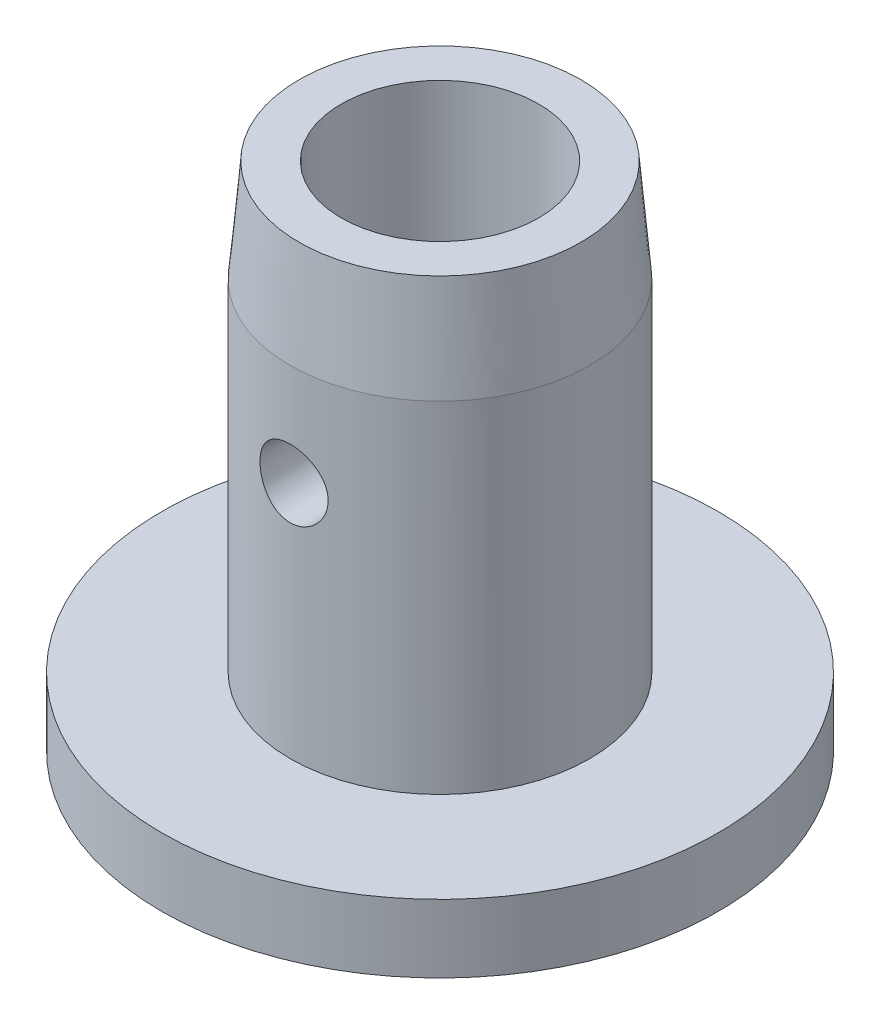
ISO-10303-21;
HEADER;
FILE_DESCRIPTION(('STEP AP214'),'2;1');
FILE_NAME('part.step','',(''),(''),'','','');
FILE_SCHEMA(('AUTOMOTIVE_DESIGN { 1 0 10303 214 1 1 1 1 }'));
ENDSEC;
DATA;
#1=APPLICATION_CONTEXT('core data for automotive mechanical design processes');
#2=APPLICATION_PROTOCOL_DEFINITION('international standard','automotive_design',2000,#1);
#3=PRODUCT_CONTEXT('',#1,'mechanical');
#4=PRODUCT('Part','Part','',(#3));
#5=PRODUCT_RELATED_PRODUCT_CATEGORY('part','',(#4));
#6=PRODUCT_DEFINITION_FORMATION('','',#4);
#7=PRODUCT_DEFINITION_CONTEXT('part definition',#1,'design');
#8=PRODUCT_DEFINITION('design','',#6,#7);
#9=PRODUCT_DEFINITION_SHAPE('','',#8);
#10=(LENGTH_UNIT() NAMED_UNIT(*) SI_UNIT(.MILLI.,.METRE.));
#11=(NAMED_UNIT(*) PLANE_ANGLE_UNIT() SI_UNIT($,.RADIAN.));
#12=(NAMED_UNIT(*) SI_UNIT($,.STERADIAN.) SOLID_ANGLE_UNIT());
#13=UNCERTAINTY_MEASURE_WITH_UNIT(LENGTH_MEASURE(1.E-05),#10,'distance_accuracy_value','');
#14=(GEOMETRIC_REPRESENTATION_CONTEXT(3) GLOBAL_UNCERTAINTY_ASSIGNED_CONTEXT((#13)) GLOBAL_UNIT_ASSIGNED_CONTEXT((#10,
#11,#12)) REPRESENTATION_CONTEXT('',''));
#15=CARTESIAN_POINT('',(0.,0.,0.));
#16=DIRECTION('',(0.,0.,1.));
#17=DIRECTION('',(1.,0.,0.));
#18=AXIS2_PLACEMENT_3D('',#15,#16,#17);
#19=CARTESIAN_POINT('',(0.,2.,0.));
#20=DIRECTION('',(0.,-1.,0.));
#21=DIRECTION('',(0.,0.,-1.));
#22=AXIS2_PLACEMENT_3D('',#19,#20,#21);
#23=CYLINDRICAL_SURFACE('',#22,8.17133289327945);
#24=CARTESIAN_POINT('',(0.,2.,0.));
#25=DIRECTION('',(0.,1.,0.));
#26=DIRECTION('',(0.,0.,1.));
#27=AXIS2_PLACEMENT_3D('',#24,#25,#26);
#28=CIRCLE('',#27,8.17133289327945);
#29=CARTESIAN_POINT('',(0.,2.,8.17133289327945));
#30=VERTEX_POINT('',#29);
#31=EDGE_CURVE('E110',#30,#30,#28,.T.);
#32=ORIENTED_EDGE('',*,*,#31,.F.);
#33=EDGE_LOOP('',(#32));
#34=FACE_BOUND('',#33,.T.);
#35=CARTESIAN_POINT('',(0.,0.,0.));
#36=DIRECTION('',(0.,1.,0.));
#37=DIRECTION('',(0.,0.,1.));
#38=AXIS2_PLACEMENT_3D('',#35,#36,#37);
#39=CIRCLE('',#38,8.17133289327945);
#40=CARTESIAN_POINT('',(0.,0.,8.17133289327945));
#41=VERTEX_POINT('',#40);
#42=EDGE_CURVE('E113',#41,#41,#39,.T.);
#43=ORIENTED_EDGE('',*,*,#42,.T.);
#44=EDGE_LOOP('',(#43));
#45=FACE_BOUND('',#44,.T.);
#46=ADVANCED_FACE('F38',(#34,#45),#23,.T.);
#47=CARTESIAN_POINT('',(0.,2.,0.));
#48=DIRECTION('',(0.,1.,0.));
#49=DIRECTION('',(0.,0.,1.));
#50=AXIS2_PLACEMENT_3D('',#47,#48,#49);
#51=PLANE('',#50);
#52=CARTESIAN_POINT('',(0.,2.,0.));
#53=DIRECTION('',(0.,1.,0.));
#54=DIRECTION('',(0.,0.,1.));
#55=AXIS2_PLACEMENT_3D('',#52,#53,#54);
#56=CIRCLE('',#55,4.4);
#57=CARTESIAN_POINT('',(0.,2.,4.4));
#58=VERTEX_POINT('',#57);
#59=EDGE_CURVE('E114',#58,#58,#56,.F.);
#60=ORIENTED_EDGE('',*,*,#59,.T.);
#61=EDGE_LOOP('',(#60));
#62=FACE_BOUND('',#61,.T.);
#63=ORIENTED_EDGE('',*,*,#31,.T.);
#64=EDGE_LOOP('',(#63));
#65=FACE_BOUND('',#64,.T.);
#66=ADVANCED_FACE('F94',(#62,#65),#51,.T.);
#67=CARTESIAN_POINT('',(0.,0.,0.));
#68=DIRECTION('',(0.,1.,0.));
#69=DIRECTION('',(0.,0.,1.));
#70=AXIS2_PLACEMENT_3D('',#67,#68,#69);
#71=PLANE('',#70);
#72=ORIENTED_EDGE('',*,*,#42,.F.);
#73=EDGE_LOOP('',(#72));
#74=FACE_BOUND('',#73,.T.);
#75=ADVANCED_FACE('F98',(#74),#71,.F.);
#76=CARTESIAN_POINT('',(0.,15.,0.));
#77=DIRECTION('',(0.,1.,0.));
#78=DIRECTION('',(0.,0.,1.));
#79=AXIS2_PLACEMENT_3D('',#76,#77,#78);
#80=PLANE('',#79);
#81=CARTESIAN_POINT('',(0.,15.,0.));
#82=DIRECTION('',(0.,1.,0.));
#83=DIRECTION('',(0.,0.,1.));
#84=AXIS2_PLACEMENT_3D('',#81,#82,#83);
#85=CIRCLE('',#84,4.13753400942223);
#86=CARTESIAN_POINT('',(0.,15.,-4.13753400942223));
#87=VERTEX_POINT('',#86);
#88=EDGE_CURVE('E51',#87,#87,#85,.T.);
#89=ORIENTED_EDGE('',*,*,#88,.T.);
#90=EDGE_LOOP('',(#89));
#91=FACE_BOUND('',#90,.T.);
#92=CARTESIAN_POINT('',(0.,15.,0.));
#93=DIRECTION('',(0.,1.,0.));
#94=DIRECTION('',(1.,0.,0.));
#95=AXIS2_PLACEMENT_3D('',#92,#93,#94);
#96=CIRCLE('',#95,2.9);
#97=CARTESIAN_POINT('',(2.9,15.,0.));
#98=VERTEX_POINT('',#97);
#99=EDGE_CURVE('E117',#98,#98,#96,.T.);
#100=ORIENTED_EDGE('',*,*,#99,.F.);
#101=EDGE_LOOP('',(#100));
#102=FACE_BOUND('',#101,.T.);
#103=ADVANCED_FACE('F92',(#91,#102),#80,.T.);
#104=CARTESIAN_POINT('',(0.,15.,0.));
#105=DIRECTION('',(0.,-1.,0.));
#106=DIRECTION('',(0.,0.,-1.));
#107=AXIS2_PLACEMENT_3D('',#104,#105,#106);
#108=CYLINDRICAL_SURFACE('',#107,4.4);
#109=CARTESIAN_POINT('',(0.,9.99999999999987,-4.4));
#110=CARTESIAN_POINT('',(-0.0554073114387617,9.9999981872693,-4.39999898940741));
#111=CARTESIAN_POINT('',(-0.110836068903203,9.9953795089691,-4.39894283738452));
#112=CARTESIAN_POINT('',(-0.220115437839729,9.97704820957519,-4.3948317281224));
#113=CARTESIAN_POINT('',(-0.273964956888292,9.96332944161776,-4.39177541985059));
#114=CARTESIAN_POINT('',(-0.378491068793966,9.92725278054711,-4.38400381249175));
#115=CARTESIAN_POINT('',(-0.429171037982589,9.90490426880757,-4.37929031542696));
#116=CARTESIAN_POINT('',(-0.526060910330264,9.85223315464752,-4.36871128065081));
#117=CARTESIAN_POINT('',(-0.572270858012729,9.8219106316629,-4.36284575441594));
#118=CARTESIAN_POINT('',(-0.659707041778552,9.7535991821572,-4.35049063267256));
#119=CARTESIAN_POINT('',(-0.700845175568196,9.71549897060986,-4.34399279033303));
#120=CARTESIAN_POINT('',(-0.776205559266441,9.63295241034497,-4.33116260473322));
#121=CARTESIAN_POINT('',(-0.810427152487135,9.58850545972209,-4.32483027723732));
#122=CARTESIAN_POINT('',(-0.871378397607147,9.49386717788639,-4.31296633476884));
#123=CARTESIAN_POINT('',(-0.8980130174263,9.44361320147753,-4.30744526322309));
#124=CARTESIAN_POINT('',(-0.942424278871479,9.33919619976722,-4.29794784590034));
#125=CARTESIAN_POINT('',(-0.960202070870996,9.28503368317522,-4.29397129952671));
#126=CARTESIAN_POINT('',(-0.986101397650873,9.17529632515325,-4.28809737879322));
#127=CARTESIAN_POINT('',(-0.994379570723015,9.11976029475085,-4.2861663189356));
#128=CARTESIAN_POINT('',(-1.00153195380595,9.00805670911462,-4.28450093627071));
#129=CARTESIAN_POINT('',(-1.00040741554621,8.95188923893496,-4.28476632106321));
#130=CARTESIAN_POINT('',(-0.988912067835049,8.84169084666039,-4.28743340143677));
#131=CARTESIAN_POINT('',(-0.978724418397751,8.7876396375219,-4.28979277651903));
#132=CARTESIAN_POINT('',(-0.949682739682008,8.68203420553794,-4.29631494690973));
#133=CARTESIAN_POINT('',(-0.930828189617153,8.63048013294899,-4.30047785058976));
#134=CARTESIAN_POINT('',(-0.884822937610176,8.53082373127565,-4.31017897538147));
#135=CARTESIAN_POINT('',(-0.857602848344031,8.48275459289439,-4.315728623913));
#136=CARTESIAN_POINT('',(-0.795687911681632,8.39179897875544,-4.32757107372966));
#137=CARTESIAN_POINT('',(-0.760991968948537,8.34891326389429,-4.33386398385385));
#138=CARTESIAN_POINT('',(-0.684146072014066,8.26848857527146,-4.34666461149003));
#139=CARTESIAN_POINT('',(-0.64184066697131,8.23109822939332,-4.35317390940599));
#140=CARTESIAN_POINT('',(-0.55148491936389,8.16391764451702,-4.36554010388633));
#141=CARTESIAN_POINT('',(-0.503434456036321,8.13412756532008,-4.37139698673173));
#142=CARTESIAN_POINT('',(-0.402763196719663,8.08295184481126,-4.3818198969855));
#143=CARTESIAN_POINT('',(-0.350131533739264,8.06158689055093,-4.38638273939494));
#144=CARTESIAN_POINT('',(-0.24189804899668,8.02804639765269,-4.39367995826793));
#145=CARTESIAN_POINT('',(-0.186296695865488,8.01586941367099,-4.39641462231136));
#146=CARTESIAN_POINT('',(-0.074975936077093,8.00126950501079,-4.39970600287024));
#147=CARTESIAN_POINT('',(-0.0192844369348151,7.99864372347317,-4.40030800736451));
#148=CARTESIAN_POINT('',(0.0917415546720417,8.00266921594104,-4.39939369020253));
#149=CARTESIAN_POINT('',(0.147076073088344,8.00931980776225,-4.39787752431647));
#150=CARTESIAN_POINT('',(0.255136670887384,8.03154126676203,-4.39292592414966));
#151=CARTESIAN_POINT('',(0.30788601472577,8.04700461857736,-4.389513634822));
#152=CARTESIAN_POINT('',(0.410041572351042,8.0862924109827,-4.38115224529469));
#153=CARTESIAN_POINT('',(0.459447485729155,8.11011760170117,-4.37620300722218));
#154=CARTESIAN_POINT('',(0.554344341024224,8.165867657422,-4.36520573100379));
#155=CARTESIAN_POINT('',(0.599764274090878,8.19791025070913,-4.35914211942128));
#156=CARTESIAN_POINT('',(0.684655094316209,8.26903173137595,-4.34661843825839));
#157=CARTESIAN_POINT('',(0.724125141431879,8.3081116106186,-4.3401583128765));
#158=CARTESIAN_POINT('',(0.796806824872384,8.39313238605323,-4.32741150857947));
#159=CARTESIAN_POINT('',(0.829877466376249,8.43919489671459,-4.32113088477013));
#160=CARTESIAN_POINT('',(0.887815257626211,8.53633855626798,-4.30960093286416));
#161=CARTESIAN_POINT('',(0.912682770004068,8.58741948318372,-4.3043515591837));
#162=CARTESIAN_POINT('',(0.953334388967711,8.69287218782743,-4.29553099482694));
#163=CARTESIAN_POINT('',(0.969170864886819,8.74722292949721,-4.29195015126808));
#164=CARTESIAN_POINT('',(0.991461033361459,8.85790676267952,-4.28685644234325));
#165=CARTESIAN_POINT('',(0.997916365366457,8.91423950605442,-4.28534321564317));
#166=CARTESIAN_POINT('',(1.00118695685666,9.02586344772422,-4.2845801177289));
#167=CARTESIAN_POINT('',(0.998226194004283,9.0811478397333,-4.28527765832708));
#168=CARTESIAN_POINT('',(0.983252461613132,9.19040756407517,-4.28873787387656));
#169=CARTESIAN_POINT('',(0.971239616868036,9.24438291444405,-4.29150052035791));
#170=CARTESIAN_POINT('',(0.938614769442436,9.34929735894638,-4.29875304108193));
#171=CARTESIAN_POINT('',(0.918037830111978,9.40024787645647,-4.30323586674681));
#172=CARTESIAN_POINT('',(0.868898146427518,9.49800588276011,-4.31342588931242));
#173=CARTESIAN_POINT('',(0.840334494924891,9.54481290013007,-4.31913322527863));
#174=CARTESIAN_POINT('',(0.775299987564197,9.63405377106198,-4.33128442905362));
#175=CARTESIAN_POINT('',(0.738670582571336,9.67637028888282,-4.33774162235145));
#176=CARTESIAN_POINT('',(0.65886251572967,9.75432927403265,-4.3505781943722));
#177=CARTESIAN_POINT('',(0.615682334162702,9.78997018838625,-4.35695755466659));
#178=CARTESIAN_POINT('',(0.523256242060226,9.85405522409335,-4.36902773556166));
#179=CARTESIAN_POINT('',(0.473932648750479,9.88238952933312,-4.37470744646846));
#180=CARTESIAN_POINT('',(0.371102387084676,9.93031998826505,-4.38462562205597));
#181=CARTESIAN_POINT('',(0.317599137735078,9.94992319791454,-4.3888652498669));
#182=CARTESIAN_POINT('',(0.220065228615849,9.97649116247032,-4.39470238051135));
#183=CARTESIAN_POINT('',(0.176547244455395,9.98528959507559,-4.39667634233995));
#184=CARTESIAN_POINT('',(0.0886907259723664,9.9970445894316,-4.3993255232295));
#185=CARTESIAN_POINT('',(0.0443522338868403,10.0000014510475,-4.40000080895532));
#186=CARTESIAN_POINT('',(0.,9.99999999999987,-4.4));
#187=B_SPLINE_CURVE_WITH_KNOTS('',3,(#109,#110,#111,#112,#113,#114,#115,#116,#117,#118,#119,
#120,#121,#122,#123,#124,#125,#126,#127,#128,#129,#130,#131,#132,#133,#134,#135,#136,#137,#138,
#139,#140,#141,#142,#143,#144,#145,#146,#147,#148,#149,#150,#151,#152,#153,#154,#155,#156,#157,
#158,#159,#160,#161,#162,#163,#164,#165,#166,#167,#168,#169,#170,#171,#172,#173,#174,#175,#176,
#177,#178,#179,#180,#181,#182,#183,#184,#185,#186),.UNSPECIFIED.,.T.,.F.,(4,2,2,2,2,2,2,2,2,2,2,
2,2,2,2,2,2,2,2,2,2,2,2,2,2,2,2,2,2,2,2,2,2,2,2,2,2,2,4),(0.,0.166059539853326,
0.332231362798772,0.498223047021274,0.664213077722099,0.832769557587234,1.00134203346321,
1.17194145189365,1.34251870615296,1.51024097959232,1.67794092547503,1.84232685669694,
2.00672266701589,2.1725206297554,2.33834290119191,2.50804612721481,2.67775292107945,
2.84787385638659,3.01796802467958,3.18442776766705,3.35087526985451,3.51533430459614,
3.67980809649233,3.84678451731507,4.0137844909027,4.18412528616158,4.35445855023791,
4.52379376763596,4.69309938843759,4.85840817580582,5.02371468423814,5.18835094630459,
5.35300591572721,5.52124410314364,5.68952138008027,5.86019710981387,6.03073465808862,
6.16366819089744,6.29659489965601),.UNSPECIFIED.);
#188=CARTESIAN_POINT('',(0.,9.99999999999987,-4.4));
#189=VERTEX_POINT('',#188);
#190=EDGE_CURVE('E83',#189,#189,#187,.T.);
#191=ORIENTED_EDGE('',*,*,#190,.T.);
#192=EDGE_LOOP('',(#191));
#193=FACE_BOUND('',#192,.T.);
#194=CARTESIAN_POINT('',(1.,8.99999999999986,4.28485705712571));
#195=CARTESIAN_POINT('',(0.999998172956961,8.9446135236298,4.28485817276947));
#196=CARTESIAN_POINT('',(0.995382849343172,8.88920556709911,4.28594265978279));
#197=CARTESIAN_POINT('',(0.977066080954317,8.7799693700087,4.29015466029158));
#198=CARTESIAN_POINT('',(0.963358404266397,8.7261422393923,4.293283575019));
#199=CARTESIAN_POINT('',(0.927314161506233,8.62166357663942,4.30121217836324));
#200=CARTESIAN_POINT('',(0.904987495890804,8.57100847816292,4.30600994937546));
#201=CARTESIAN_POINT('',(0.85236789996246,8.4741606401303,4.31673335036008));
#202=CARTESIAN_POINT('',(0.822075000351155,8.42796788337741,4.32265897598575));
#203=CARTESIAN_POINT('',(0.75379411214335,8.34051380765069,4.33509112165164));
#204=CARTESIAN_POINT('',(0.715688176080844,8.29934568783543,4.34160556858043));
#205=CARTESIAN_POINT('',(0.633117384229795,8.22392699795641,4.3544121154511));
#206=CARTESIAN_POINT('',(0.588652009804052,8.18967699264218,4.36070419720597));
#207=CARTESIAN_POINT('',(0.493996085137725,8.12869478069098,4.37244376401872));
#208=CARTESIAN_POINT('',(0.443746051303528,8.10205271982757,4.37788080393899));
#209=CARTESIAN_POINT('',(0.339337542254579,8.05762663263464,4.38720790566126));
#210=CARTESIAN_POINT('',(0.285179542169808,8.03984153154772,4.39109815514866));
#211=CARTESIAN_POINT('',(0.175462237558956,8.01392876170034,4.39683732833272));
#212=CARTESIAN_POINT('',(0.119941995001517,8.00564320905687,4.39871958722701));
#213=CARTESIAN_POINT('',(0.00826978361641531,7.99847058676739,4.40034637117151));
#214=CARTESIAN_POINT('',(-0.0478821065769237,7.99958235989349,4.40009115943927));
#215=CARTESIAN_POINT('',(-0.158133548364819,8.01105629142925,4.39749706190389));
#216=CARTESIAN_POINT('',(-0.212251852649814,8.02124821120537,4.39519652442152));
#217=CARTESIAN_POINT('',(-0.317989212463346,8.05032123186044,4.38881420037801));
#218=CARTESIAN_POINT('',(-0.369608149136813,8.06920274551721,4.38473232919947));
#219=CARTESIAN_POINT('',(-0.469347777502738,8.11526616394671,4.37518508731984));
#220=CARTESIAN_POINT('',(-0.51743809759723,8.14251156029417,4.36970919059859));
#221=CARTESIAN_POINT('',(-0.608425599826465,8.20448180478223,4.35797268584388));
#222=CARTESIAN_POINT('',(-0.651322020862756,8.23920774703265,4.35171196307727));
#223=CARTESIAN_POINT('',(-0.73171741770942,8.31607656626518,4.33892684265754));
#224=CARTESIAN_POINT('',(-0.769073659913915,8.35836840432002,4.33239968078324));
#225=CARTESIAN_POINT('',(-0.836191680292531,8.44868432629483,4.31994816179905));
#226=CARTESIAN_POINT('',(-0.865953218000971,8.49670859164589,4.31402382377951));
#227=CARTESIAN_POINT('',(-0.917107549511339,8.59736959524376,4.30344067165455));
#228=CARTESIAN_POINT('',(-0.938471463876041,8.65002150156778,4.29878624125749));
#229=CARTESIAN_POINT('',(-0.97200383571757,8.75829942149559,4.29132924906935));
#230=CARTESIAN_POINT('',(-0.984173881419264,8.81392491963799,4.28852636743694));
#231=CARTESIAN_POINT('',(-0.998747680773503,8.92526169906461,4.28515557682541));
#232=CARTESIAN_POINT('',(-1.00136010080838,8.98094425312535,4.28453992406901));
#233=CARTESIAN_POINT('',(-0.997311090863266,9.09194928325798,4.28548419957068));
#234=CARTESIAN_POINT('',(-0.990650353148969,9.1472717858989,4.28704396542803));
#235=CARTESIAN_POINT('',(-0.968425670646868,9.25524731752322,4.29211806935084));
#236=CARTESIAN_POINT('',(-0.952978346986551,9.30792566672219,4.29560678850196));
#237=CARTESIAN_POINT('',(-0.913746038145776,9.40994623697216,4.30412228125607));
#238=CARTESIAN_POINT('',(-0.889960203375691,9.45928811746755,4.30914921157684));
#239=CARTESIAN_POINT('',(-0.834272384379994,9.5541332156156,4.32027846937097));
#240=CARTESIAN_POINT('',(-0.802242843557105,9.59955957561622,4.32639718668424));
#241=CARTESIAN_POINT('',(-0.731142232702455,9.68446932129828,4.33897817783519));
#242=CARTESIAN_POINT('',(-0.69207021495919,9.72395190580734,4.34544049782913));
#243=CARTESIAN_POINT('',(-0.607045959247314,9.7966724392062,4.35813909702996));
#244=CARTESIAN_POINT('',(-0.560970301290904,9.82976756988818,4.36436813813295));
#245=CARTESIAN_POINT('',(-0.463792670514797,9.88774832572189,4.37576120031238));
#246=CARTESIAN_POINT('',(-0.412690941867461,9.91263434942609,4.3809252730885));
#247=CARTESIAN_POINT('',(-0.307242019726363,9.95329616443185,4.38957623439594));
#248=CARTESIAN_POINT('',(-0.252918978508358,9.96913213095943,4.39307417474498));
#249=CARTESIAN_POINT('',(-0.14229451323299,9.99143061894159,4.39804670357271));
#250=CARTESIAN_POINT('',(-0.0859934024474909,9.99789461786559,4.39952161097596));
#251=CARTESIAN_POINT('',(0.0256370570914236,10.0011948464686,4.40027149211534));
#252=CARTESIAN_POINT('',(0.0809599009755024,9.99824363140224,4.3995950355303));
#253=CARTESIAN_POINT('',(0.190299115891744,9.98327562052863,4.3962232064448));
#254=CARTESIAN_POINT('',(0.244315514120923,9.97125901360871,4.39352787600978));
#255=CARTESIAN_POINT('',(0.349328813687535,9.93860654431528,4.38642579305679));
#256=CARTESIAN_POINT('',(0.400336233136022,9.91800302195907,4.3820254662177));
#257=CARTESIAN_POINT('',(0.498197263471666,9.86879230925602,4.37198147671218));
#258=CARTESIAN_POINT('',(0.545050436696177,9.84018427692565,4.36633768326047));
#259=CARTESIAN_POINT('',(0.634302521137273,9.77509521414182,4.3542774053487));
#260=CARTESIAN_POINT('',(0.676591592587167,9.73846603423756,4.34784755156389));
#261=CARTESIAN_POINT('',(0.754495319914402,9.65867041188418,4.33500855980384));
#262=CARTESIAN_POINT('',(0.790108346416117,9.61550237817868,4.32859942726003));
#263=CARTESIAN_POINT('',(0.854156028821747,9.52309120246178,4.3164219710509));
#264=CARTESIAN_POINT('',(0.88247751886789,9.47376811481237,4.31066444700259));
#265=CARTESIAN_POINT('',(0.930384150346576,9.37094045945109,4.3005800960967));
#266=CARTESIAN_POINT('',(0.949976421612277,9.31743934639512,4.29625210238051));
#267=CARTESIAN_POINT('',(0.976519641845292,9.21993281701977,4.2902853761763));
#268=CARTESIAN_POINT('',(0.985307313189316,9.17644153097361,4.28826372072279));
#269=CARTESIAN_POINT('',(0.997048057349155,9.08863805127284,4.28554915257795));
#270=CARTESIAN_POINT('',(1.00000146218609,9.0443259044773,4.28485616427384));
#271=CARTESIAN_POINT('',(1.,8.99999999999986,4.28485705712571));
#272=B_SPLINE_CURVE_WITH_KNOTS('',3,(#194,#195,#196,#197,#198,#199,#200,#201,#202,#203,#204,
#205,#206,#207,#208,#209,#210,#211,#212,#213,#214,#215,#216,#217,#218,#219,#220,#221,#222,#223,
#224,#225,#226,#227,#228,#229,#230,#231,#232,#233,#234,#235,#236,#237,#238,#239,#240,#241,#242,
#243,#244,#245,#246,#247,#248,#249,#250,#251,#252,#253,#254,#255,#256,#257,#258,#259,#260,#261,
#262,#263,#264,#265,#266,#267,#268,#269,#270,#271),.UNSPECIFIED.,.T.,.F.,(4,2,2,2,2,2,2,2,2,2,2,
2,2,2,2,2,2,2,2,2,2,2,2,2,2,2,2,2,2,2,2,2,2,2,2,2,2,2,4),(0.,0.165996897304268,
0.332107686866146,0.498028233398954,0.663948140488661,0.832586549056412,1.00123871860007,
1.17181335496867,1.34236728772629,1.51004351270337,1.67769908959608,1.84227602663752,
2.00686078230906,2.17272718731547,2.33861786854887,2.50823146034773,2.67785042183393,
2.84804770384368,3.01821557784071,3.18464532088969,3.35106264018548,3.51532104907985,
3.67959619871091,3.84658448380192,4.0135952574345,4.1839917038932,4.35437987637933,
4.52362152049452,4.69283648114635,4.85825855136596,5.02367717493189,5.18847835000317,
5.35329686680728,5.52146406492036,5.68967225314152,5.86035204221535,6.03089216709,
6.16374736685087,6.29659500576361),.UNSPECIFIED.);
#273=CARTESIAN_POINT('',(1.,8.99999999999986,4.28485705712571));
#274=VERTEX_POINT('',#273);
#275=EDGE_CURVE('E77',#274,#274,#272,.T.);
#276=ORIENTED_EDGE('',*,*,#275,.T.);
#277=EDGE_LOOP('',(#276));
#278=FACE_BOUND('',#277,.T.);
#279=CARTESIAN_POINT('',(0.,11.9999999999999,0.));
#280=DIRECTION('',(0.,1.,0.));
#281=DIRECTION('',(0.,0.,1.));
#282=AXIS2_PLACEMENT_3D('',#279,#280,#281);
#283=CIRCLE('',#282,4.4);
#284=CARTESIAN_POINT('',(0.,11.9999999999999,-4.4));
#285=VERTEX_POINT('',#284);
#286=EDGE_CURVE('E11',#285,#285,#283,.F.);
#287=ORIENTED_EDGE('',*,*,#286,.T.);
#288=EDGE_LOOP('',(#287));
#289=FACE_BOUND('',#288,.T.);
#290=ORIENTED_EDGE('',*,*,#59,.F.);
#291=EDGE_LOOP('',(#290));
#292=FACE_BOUND('',#291,.T.);
#293=ADVANCED_FACE('F88',(#193,#278,#289,#292),#108,.T.);
#294=CARTESIAN_POINT('',(0.,15.,0.));
#295=DIRECTION('',(0.,-1.,0.));
#296=DIRECTION('',(0.,0.,-1.));
#297=AXIS2_PLACEMENT_3D('',#294,#295,#296);
#298=CYLINDRICAL_SURFACE('',#297,2.9);
#299=CARTESIAN_POINT('',(0.,9.99999999999987,-2.9));
#300=CARTESIAN_POINT('',(-0.0544552131136731,10.0000006506837,-2.90000044596642));
#301=CARTESIAN_POINT('',(-0.108905818143274,9.99553760558662,-2.89845224840839));
#302=CARTESIAN_POINT('',(-0.216196775235785,9.9778625828751,-2.89242923061449));
#303=CARTESIAN_POINT('',(-0.269037070312184,9.964650296013,-2.88795430693165));
#304=CARTESIAN_POINT('',(-0.371545174459086,9.92998803148389,-2.87656253190446));
#305=CARTESIAN_POINT('',(-0.421218333321002,9.90855239870091,-2.8696499345483));
#306=CARTESIAN_POINT('',(-0.516263627133062,9.85811892742604,-2.85408377479631));
#307=CARTESIAN_POINT('',(-0.561634820702117,9.82911943895072,-2.84542983263685));
#308=CARTESIAN_POINT('',(-0.64845582065183,9.76326361656829,-2.82693147875981));
#309=CARTESIAN_POINT('',(-0.689725893574247,9.72617879916895,-2.8170571236675));
#310=CARTESIAN_POINT('',(-0.765600385970797,9.64569051696745,-2.79739079412223));
#311=CARTESIAN_POINT('',(-0.800203196229213,9.60228553115176,-2.78759884010168));
#312=CARTESIAN_POINT('',(-0.86281727541276,9.50873463339349,-2.76887163076295));
#313=CARTESIAN_POINT('',(-0.890589582412287,9.45842083096769,-2.75997257294439));
#314=CARTESIAN_POINT('',(-0.937200454960444,9.35348038290123,-2.74449684570883));
#315=CARTESIAN_POINT('',(-0.956041966482225,9.29885516639866,-2.73791941064857));
#316=CARTESIAN_POINT('',(-0.983572670144409,9.18889409302674,-2.7281482054121));
#317=CARTESIAN_POINT('',(-0.992600441334165,9.13365330625254,-2.72484197013287));
#318=CARTESIAN_POINT('',(-1.00130604229978,9.02234969381725,-2.72165570572462));
#319=CARTESIAN_POINT('',(-1.00098700566359,8.96628714995655,-2.72177452831886));
#320=CARTESIAN_POINT('',(-0.991269850118853,8.85787207614402,-2.72532681352706));
#321=CARTESIAN_POINT('',(-0.982320585940334,8.80547299799653,-2.72859640013378));
#322=CARTESIAN_POINT('',(-0.956331839402051,8.70297153823126,-2.73781254728096));
#323=CARTESIAN_POINT('',(-0.939291324321129,8.65286945068363,-2.74375944953372));
#324=CARTESIAN_POINT('',(-0.897322903330796,8.55539258607528,-2.75777199360075));
#325=CARTESIAN_POINT('',(-0.872266490935071,8.50807825649422,-2.76587176369009));
#326=CARTESIAN_POINT('',(-0.815066789795993,8.41818695276921,-2.783263880601));
#327=CARTESIAN_POINT('',(-0.782921341272507,8.37561142833372,-2.79255659050807));
#328=CARTESIAN_POINT('',(-0.710327432141071,8.29389358509846,-2.81192482917279));
#329=CARTESIAN_POINT('',(-0.66951422536393,8.25507806552534,-2.82201502155233));
#330=CARTESIAN_POINT('',(-0.581835205740511,8.18475380208939,-2.84138718920041));
#331=CARTESIAN_POINT('',(-0.534968728887011,8.15324586088543,-2.85066907561537));
#332=CARTESIAN_POINT('',(-0.435783492056977,8.09814312054725,-2.86751598276309));
#333=CARTESIAN_POINT('',(-0.383409250154941,8.07464147960904,-2.87506048104625));
#334=CARTESIAN_POINT('',(-0.2751274425281,8.03688574415438,-2.88743285339349));
#335=CARTESIAN_POINT('',(-0.21922120271381,8.02262820177992,-2.89226174023537));
#336=CARTESIAN_POINT('',(-0.108224709923492,8.00435732086242,-2.89848829144024));
#337=CARTESIAN_POINT('',(-0.0532152680158842,7.9999028170644,-2.90003360783231));
#338=CARTESIAN_POINT('',(0.056779550915997,8.00010035885299,-2.89996529704204));
#339=CARTESIAN_POINT('',(0.111764930499342,8.00475074403706,-2.89835224583175));
#340=CARTESIAN_POINT('',(0.218347956211726,8.0226802857086,-2.89224600856489));
#341=CARTESIAN_POINT('',(0.269997763336055,8.03568385256146,-2.88784486957406));
#342=CARTESIAN_POINT('',(0.370357971541551,8.06960125249792,-2.87669713597174));
#343=CARTESIAN_POINT('',(0.41906799267972,8.090516105522,-2.86995023894901));
#344=CARTESIAN_POINT('',(0.513648423190477,8.14029137179801,-2.85456212899072));
#345=CARTESIAN_POINT('',(0.559405187888158,8.16935288865492,-2.84587427954393));
#346=CARTESIAN_POINT('',(0.645533254519413,8.2343628787571,-2.82758351550565));
#347=CARTESIAN_POINT('',(0.685902804987562,8.27031358257312,-2.81798030504744));
#348=CARTESIAN_POINT('',(0.762163237880085,8.35015331993382,-2.79834486508445));
#349=CARTESIAN_POINT('',(0.797739503725268,8.39434408738377,-2.78831456408555));
#350=CARTESIAN_POINT('',(0.861016541925032,8.48828024570908,-2.76943033661311));
#351=CARTESIAN_POINT('',(0.888717109397741,8.53802578104172,-2.76057644074627));
#352=CARTESIAN_POINT('',(0.935361434808084,8.64176847153171,-2.74512401059867));
#353=CARTESIAN_POINT('',(0.954311078797978,8.69576274020966,-2.73852396111492));
#354=CARTESIAN_POINT('',(0.982752974203085,8.80645933943221,-2.72844803900345));
#355=CARTESIAN_POINT('',(0.992249888363337,8.86316032035836,-2.72497062615665));
#356=CARTESIAN_POINT('',(1.00113784748312,8.97431251376181,-2.72171694741471));
#357=CARTESIAN_POINT('',(1.00105477688971,9.02871647449048,-2.72174808083967));
#358=CARTESIAN_POINT('',(0.992093555043035,9.13669128524179,-2.72502708681539));
#359=CARTESIAN_POINT('',(0.983216000098469,9.19026219149942,-2.72827474127043));
#360=CARTESIAN_POINT('',(0.957300754008808,9.29388244154613,-2.73747268908473));
#361=CARTESIAN_POINT('',(0.940444949368938,9.34398306532212,-2.74336259585187));
#362=CARTESIAN_POINT('',(0.899202062594745,9.44068174980649,-2.75715545901479));
#363=CARTESIAN_POINT('',(0.874813238279691,9.4872789971771,-2.76505888100725));
#364=CARTESIAN_POINT('',(0.817886181877109,9.5779789519226,-2.78244237950148));
#365=CARTESIAN_POINT('',(0.785024027508346,9.62186755615343,-2.79197835282225));
#366=CARTESIAN_POINT('',(0.712618196014424,9.7036767739812,-2.81133029201349));
#367=CARTESIAN_POINT('',(0.673072567850672,9.74159563863147,-2.82114633894552));
#368=CARTESIAN_POINT('',(0.586391890905794,9.81203064553149,-2.84045700643123));
#369=CARTESIAN_POINT('',(0.539004418543626,9.8442460125274,-2.84991987810608));
#370=CARTESIAN_POINT('',(0.439168450163447,9.90022463483973,-2.86700043276144));
#371=CARTESIAN_POINT('',(0.386720826784196,9.92398934419783,-2.87461843310318));
#372=CARTESIAN_POINT('',(0.279395305096888,9.96182370897986,-2.8870038017781));
#373=CARTESIAN_POINT('',(0.224594079770421,9.9760911524302,-2.89182903316074));
#374=CARTESIAN_POINT('',(0.113193181266236,9.99517741573334,-2.89832638525487));
#375=CARTESIAN_POINT('',(0.056594102040427,9.99999932375852,-2.89999953651693));
#376=CARTESIAN_POINT('',(0.,9.99999999999987,-2.9));
#377=B_SPLINE_CURVE_WITH_KNOTS('',3,(#299,#300,#301,#302,#303,#304,#305,#306,#307,#308,#309,
#310,#311,#312,#313,#314,#315,#316,#317,#318,#319,#320,#321,#322,#323,#324,#325,#326,#327,#328,
#329,#330,#331,#332,#333,#334,#335,#336,#337,#338,#339,#340,#341,#342,#343,#344,#345,#346,#347,
#348,#349,#350,#351,#352,#353,#354,#355,#356,#357,#358,#359,#360,#361,#362,#363,#364,#365,#366,
#367,#368,#369,#370,#371,#372,#373,#374,#375,#376),.UNSPECIFIED.,.T.,.F.,(4,2,2,2,2,2,2,2,2,2,2,
2,2,2,2,2,2,2,2,2,2,2,2,2,2,2,2,2,2,2,2,2,2,2,2,2,2,2,4),(0.,0.163157241751648,
0.326320250710067,0.48919992132834,0.652115152361773,0.820428202852931,0.988781826764585,
1.16238081172212,1.33592249221288,1.50326568890017,1.6705527831586,1.82958379970164,
1.98863511951579,2.1503760713389,2.31216636818928,2.48303708621215,2.65392656366623,
2.82674147346516,2.99949188973283,3.16429383665138,3.32906573245316,3.48866266177898,
3.6482801737098,3.81225002286218,3.97627305190564,4.14829884441868,4.32032911167672,
4.49224349867338,4.6640730434276,4.82647490915731,4.98886576400628,5.14772074341058,
5.30661248915597,5.47283092048882,5.63909795835676,5.81248271419456,5.98583762255759,
6.15545881175406,6.32502453485668),.UNSPECIFIED.);
#378=CARTESIAN_POINT('',(0.,9.99999999999987,-2.9));
#379=VERTEX_POINT('',#378);
#380=EDGE_CURVE('E42',#379,#379,#377,.T.);
#381=ORIENTED_EDGE('',*,*,#380,.F.);
#382=EDGE_LOOP('',(#381));
#383=FACE_BOUND('',#382,.T.);
#384=CARTESIAN_POINT('',(1.,8.99999999999986,2.72213151776324));
#385=CARTESIAN_POINT('',(1.00000067039053,8.94565364674606,2.72213096817236));
#386=CARTESIAN_POINT('',(0.995554785975742,8.89131194219977,2.72377679060496));
#387=CARTESIAN_POINT('',(0.977954128511451,8.78424612983763,2.73014497103169));
#388=CARTESIAN_POINT('',(0.964798414654597,8.73152219741205,2.73486766137817));
#389=CARTESIAN_POINT('',(0.930301318713786,8.62926187133786,2.7467923988472));
#390=CARTESIAN_POINT('',(0.908976900124987,8.57971911880988,2.75398930474897));
#391=CARTESIAN_POINT('',(0.858806291721031,8.48489722329126,2.770043876371));
#392=CARTESIAN_POINT('',(0.829958266485915,8.43961912435719,2.77890194719206));
#393=CARTESIAN_POINT('',(0.764264356348112,8.35271438505936,2.79769698503333));
#394=CARTESIAN_POINT('',(0.727155845888215,8.31129232603229,2.80766218442513));
#395=CARTESIAN_POINT('',(0.646553956103111,8.23511853664806,2.82731087489011));
#396=CARTESIAN_POINT('',(0.603059470690049,8.20036796424201,2.83699431681242));
#397=CARTESIAN_POINT('',(0.509409210849398,8.13758035379762,2.85531760174885));
#398=CARTESIAN_POINT('',(0.459100408940665,8.10975979403195,2.86392040229607));
#399=CARTESIAN_POINT('',(0.354168959324023,8.06305851381771,2.87877869642566));
#400=CARTESIAN_POINT('',(0.299547566701281,8.04417520348643,2.88503486991668));
#401=CARTESIAN_POINT('',(0.189688016048091,8.01658445221576,2.89429492747853));
#402=CARTESIAN_POINT('',(0.13454759737776,8.00752608723686,2.89741066675139));
#403=CARTESIAN_POINT('',(0.0234472451110323,7.99872427180826,2.90043700557986));
#404=CARTESIAN_POINT('',(-0.0325124585100363,7.99897825563602,2.90034848796698));
#405=CARTESIAN_POINT('',(-0.141170750894072,8.00857615080776,2.8970508633871));
#406=CARTESIAN_POINT('',(-0.193907687019568,8.01753843019215,2.89397277372471));
#407=CARTESIAN_POINT('',(-0.297077126228614,8.04366454245472,2.88520830266225));
#408=CARTESIAN_POINT('',(-0.347509470330389,8.06082894022127,2.87952174161515));
#409=CARTESIAN_POINT('',(-0.44544637165763,8.10308239780399,2.86601753171398));
#410=CARTESIAN_POINT('',(-0.492901821121329,8.12827599219173,2.85817196937094));
#411=CARTESIAN_POINT('',(-0.583020908533712,8.18578501695132,2.84116047240344));
#412=CARTESIAN_POINT('',(-0.625683145231247,8.21810252179587,2.83199415344636));
#413=CARTESIAN_POINT('',(-0.707270207123415,8.2908433341229,2.81275913691606));
#414=CARTESIAN_POINT('',(-0.745900222756485,8.33159191804017,2.80266823872829));
#415=CARTESIAN_POINT('',(-0.815878106849713,8.41906887687793,2.78310372675573));
#416=CARTESIAN_POINT('',(-0.84722468304484,8.4657983106739,2.77363022272637));
#417=CARTESIAN_POINT('',(-0.902193395105583,8.56490443612349,2.75624651291211));
#418=CARTESIAN_POINT('',(-0.92568219490477,8.61736033716704,2.74836411312267));
#419=CARTESIAN_POINT('',(-0.963389918470953,8.72582419895171,2.73537608483788));
#420=CARTESIAN_POINT('',(-0.977613056784352,8.78183053201714,2.73026919405965));
#421=CARTESIAN_POINT('',(-0.995767012577902,8.8929331201525,2.72369920188126));
#422=CARTESIAN_POINT('',(-1.0001580474889,8.94794454180146,2.72207333362319));
#423=CARTESIAN_POINT('',(-0.99983332363683,9.05793048613583,2.72219287176705));
#424=CARTESIAN_POINT('',(-0.995119371432491,9.11290501397651,2.72393760939291));
#425=CARTESIAN_POINT('',(-0.977133133508352,9.21909522782269,2.73043865819712));
#426=CARTESIAN_POINT('',(-0.964189810649786,9.27037450405034,2.73507908945605));
#427=CARTESIAN_POINT('',(-0.930512003283915,9.37001993437246,2.74671852071882));
#428=CARTESIAN_POINT('',(-0.909776077765258,9.41838554775062,2.75371795692615));
#429=CARTESIAN_POINT('',(-0.860317320375463,9.51262059736614,2.76957543668579));
#430=CARTESIAN_POINT('',(-0.831351098930019,9.55835291546017,2.77848769866309));
#431=CARTESIAN_POINT('',(-0.766525198508824,9.64447348063985,2.79706530861662));
#432=CARTESIAN_POINT('',(-0.730663352011194,9.6848600406205,2.80673089281722));
#433=CARTESIAN_POINT('',(-0.650849069960636,9.76131808435142,2.82633465310071));
#434=CARTESIAN_POINT('',(-0.606572619727058,9.79705544248208,2.83626082204725));
#435=CARTESIAN_POINT('',(-0.512406246866372,9.86061952450672,2.85477478638512));
#436=CARTESIAN_POINT('',(-0.462516478488216,9.88844646569778,2.8633626185373));
#437=CARTESIAN_POINT('',(-0.358742033331737,9.93515836809675,2.87819941574739));
#438=CARTESIAN_POINT('',(-0.304883150050623,9.95409603190857,2.88446211848036));
#439=CARTESIAN_POINT('',(-0.194484434289933,9.9825588206652,2.89400065466379));
#440=CARTESIAN_POINT('',(-0.137945654483807,9.99208760986237,2.89727765084847));
#441=CARTESIAN_POINT('',(-0.0268379446636825,10.0011144427235,2.90038172692035));
#442=CARTESIAN_POINT('',(0.0276879427928684,10.0010906647976,2.90037326941152));
#443=CARTESIAN_POINT('',(0.135922759564276,9.99220598602623,2.89731864532941));
#444=CARTESIAN_POINT('',(0.189631762714146,9.98334588873882,2.8942727549745));
#445=CARTESIAN_POINT('',(0.293740355986235,9.95736333391865,2.88555009439901));
#446=CARTESIAN_POINT('',(0.344182100044157,9.94039238362032,2.8799216394446));
#447=CARTESIAN_POINT('',(0.441518179388974,9.89881262709484,2.86661427989057));
#448=CARTESIAN_POINT('',(0.488411857857401,9.87420241096729,2.85893499682734));
#449=CARTESIAN_POINT('',(0.579291475429865,9.81695509823853,2.84194324776721));
#450=CARTESIAN_POINT('',(0.623095946078553,9.78404543362894,2.83257928487321));
#451=CARTESIAN_POINT('',(0.704714909487818,9.71158765404551,2.81338549840389));
#452=CARTESIAN_POINT('',(0.742527416449862,9.67203734720079,2.80355552178316));
#453=CARTESIAN_POINT('',(0.812736414904439,9.58540440190609,2.78403402279659));
#454=CARTESIAN_POINT('',(0.844832663197237,9.53807222719226,2.7743663394175));
#455=CARTESIAN_POINT('',(0.90060084956767,9.43838148552159,2.75676933528975));
#456=CARTESIAN_POINT('',(0.924274238086444,9.38602378594858,2.74883971533186));
#457=CARTESIAN_POINT('',(0.961962022472812,9.27889304969277,2.73587657813208));
#458=CARTESIAN_POINT('',(0.976176413615539,9.22419792044053,2.7307834933654));
#459=CARTESIAN_POINT('',(0.995193105328668,9.11299968048685,2.72391193507023));
#460=CARTESIAN_POINT('',(0.999999303076079,9.05649732825725,2.72213208910639));
#461=CARTESIAN_POINT('',(1.,8.99999999999986,2.72213151776324));
#462=B_SPLINE_CURVE_WITH_KNOTS('',3,(#384,#385,#386,#387,#388,#389,#390,#391,#392,#393,#394,
#395,#396,#397,#398,#399,#400,#401,#402,#403,#404,#405,#406,#407,#408,#409,#410,#411,#412,#413,
#414,#415,#416,#417,#418,#419,#420,#421,#422,#423,#424,#425,#426,#427,#428,#429,#430,#431,#432,
#433,#434,#435,#436,#437,#438,#439,#440,#441,#442,#443,#444,#445,#446,#447,#448,#449,#450,#451,
#452,#453,#454,#455,#456,#457,#458,#459,#460,#461),.UNSPECIFIED.,.T.,.F.,(4,2,2,2,2,2,2,2,2,2,2,
2,2,2,2,2,2,2,2,2,2,2,2,2,2,2,2,2,2,2,2,2,2,2,2,2,2,2,4),(0.,0.162829530256388,
0.325676651697388,0.488187414951729,0.650737860631764,0.819475402622872,0.988242205487408,
1.16175892069907,1.33522532249911,1.50226816886039,1.6692649922061,1.82925881829198,
1.9892636649061,2.15144315919221,2.31366994245289,2.48403405598355,2.65442837334341,
2.8275825627349,3.00065793672271,3.16544592739356,3.33020122514598,3.48875238666565,
3.64733288197129,3.81120417913491,3.97512707089549,4.14758427583316,4.32003674295823,
4.49145344360507,4.66280336027377,4.82557703924271,4.9883359172325,5.1481667650775,
5.30802712880787,5.47404241903789,5.64011261389707,5.81327470093697,5.98640695450922,
6.15575127954074,6.3250254418369),.UNSPECIFIED.);
#463=CARTESIAN_POINT('',(1.,8.99999999999986,2.72213151776324));
#464=VERTEX_POINT('',#463);
#465=EDGE_CURVE('E59',#464,#464,#462,.T.);
#466=ORIENTED_EDGE('',*,*,#465,.F.);
#467=EDGE_LOOP('',(#466));
#468=FACE_BOUND('',#467,.T.);
#469=CARTESIAN_POINT('',(0.,2.,0.));
#470=DIRECTION('',(0.,1.,0.));
#471=DIRECTION('',(0.,0.,1.));
#472=AXIS2_PLACEMENT_3D('',#469,#470,#471);
#473=CIRCLE('',#472,2.9);
#474=CARTESIAN_POINT('',(0.,2.,2.9));
#475=VERTEX_POINT('',#474);
#476=EDGE_CURVE('E56',#475,#475,#473,.F.);
#477=ORIENTED_EDGE('',*,*,#476,.T.);
#478=EDGE_LOOP('',(#477));
#479=FACE_BOUND('',#478,.T.);
#480=ORIENTED_EDGE('',*,*,#99,.T.);
#481=EDGE_LOOP('',(#480));
#482=FACE_BOUND('',#481,.T.);
#483=ADVANCED_FACE('F64',(#383,#468,#479,#482),#298,.F.);
#484=ORIENTED_EDGE('',*,*,#476,.F.);
#485=EDGE_LOOP('',(#484));
#486=FACE_BOUND('',#485,.T.);
#487=ADVANCED_FACE('F100',(#486),#51,.T.);
#488=CARTESIAN_POINT('',(0.,15.,0.));
#489=DIRECTION('',(0.,-1.,0.));
#490=DIRECTION('',(0.,0.,-1.));
#491=AXIS2_PLACEMENT_3D('',#488,#489,#490);
#492=CONICAL_SURFACE('',#491,4.13753400942223,0.087266462599713);
#493=CARTESIAN_POINT('',(0.,11.9999999999999,-4.4));
#494=CARTESIAN_POINT('',(0.,12.0312499999999,-4.39726597926481));
#495=CARTESIAN_POINT('',(0.,12.0624999999999,-4.39453195852963));
#496=CARTESIAN_POINT('',(0.,12.1249999999999,-4.38906391705926));
#497=CARTESIAN_POINT('',(0.,12.1562499999999,-4.38632989632407));
#498=CARTESIAN_POINT('',(0.,12.2187499999999,-4.3808618548537));
#499=CARTESIAN_POINT('',(0.,12.2499999999999,-4.37812783411852));
#500=CARTESIAN_POINT('',(0.,12.3124999999999,-4.37265979264815));
#501=CARTESIAN_POINT('',(0.,12.3437499999999,-4.36992577191296));
#502=CARTESIAN_POINT('',(0.,12.4062499999999,-4.36445773044259));
#503=CARTESIAN_POINT('',(0.,12.4374999999999,-4.36172370970741));
#504=CARTESIAN_POINT('',(0.,12.4999999999999,-4.35625566823704));
#505=CARTESIAN_POINT('',(0.,12.5312499999999,-4.35352164750185));
#506=CARTESIAN_POINT('',(0.,12.5937499999999,-4.34805360603148));
#507=CARTESIAN_POINT('',(0.,12.6249999999999,-4.3453195852963));
#508=CARTESIAN_POINT('',(0.,12.6874999999999,-4.33985154382593));
#509=CARTESIAN_POINT('',(0.,12.7187499999999,-4.33711752309074));
#510=CARTESIAN_POINT('',(0.,12.7812499999999,-4.33164948162037));
#511=CARTESIAN_POINT('',(0.,12.8124999999999,-4.32891546088519));
#512=CARTESIAN_POINT('',(0.,12.8749999999999,-4.32344741941482));
#513=CARTESIAN_POINT('',(0.,12.9062499999999,-4.32071339867963));
#514=CARTESIAN_POINT('',(0.,12.9687499999999,-4.31524535720926));
#515=CARTESIAN_POINT('',(0.,12.9999999999999,-4.31251133647408));
#516=CARTESIAN_POINT('',(0.,13.0624999999999,-4.30704329500371));
#517=CARTESIAN_POINT('',(0.,13.0937499999999,-4.30430927426852));
#518=CARTESIAN_POINT('',(0.,13.1562499999999,-4.29884123279815));
#519=CARTESIAN_POINT('',(0.,13.1874999999999,-4.29610721206296));
#520=CARTESIAN_POINT('',(0.,13.2499999999999,-4.29063917059259));
#521=CARTESIAN_POINT('',(0.,13.2812499999999,-4.28790514985741));
#522=CARTESIAN_POINT('',(0.,13.3437499999999,-4.28243710838704));
#523=CARTESIAN_POINT('',(0.,13.3749999999999,-4.27970308765185));
#524=CARTESIAN_POINT('',(0.,13.4374999999999,-4.27423504618148));
#525=CARTESIAN_POINT('',(0.,13.4687499999999,-4.2715010254463));
#526=CARTESIAN_POINT('',(0.,13.5312499999999,-4.26603298397593));
#527=CARTESIAN_POINT('',(0.,13.5624999999999,-4.26329896324074));
#528=CARTESIAN_POINT('',(0.,13.6249999999999,-4.25783092177037));
#529=CARTESIAN_POINT('',(0.,13.6562499999999,-4.25509690103519));
#530=CARTESIAN_POINT('',(0.,13.7187499999999,-4.24962885956482));
#531=CARTESIAN_POINT('',(0.,13.7499999999999,-4.24689483882963));
#532=CARTESIAN_POINT('',(0.,13.8124999999999,-4.24142679735926));
#533=CARTESIAN_POINT('',(0.,13.8437499999999,-4.23869277662408));
#534=CARTESIAN_POINT('',(0.,13.90625,-4.23322473515371));
#535=CARTESIAN_POINT('',(0.,13.9375,-4.23049071441852));
#536=CARTESIAN_POINT('',(0.,14.,-4.22502267294815));
#537=CARTESIAN_POINT('',(0.,14.03125,-4.22228865221297));
#538=CARTESIAN_POINT('',(0.,14.09375,-4.2168206107426));
#539=CARTESIAN_POINT('',(0.,14.125,-4.21408659000741));
#540=CARTESIAN_POINT('',(0.,14.1875,-4.20861854853704));
#541=CARTESIAN_POINT('',(0.,14.21875,-4.20588452780185));
#542=CARTESIAN_POINT('',(0.,14.28125,-4.20041648633149));
#543=CARTESIAN_POINT('',(0.,14.3125,-4.1976824655963));
#544=CARTESIAN_POINT('',(0.,14.375,-4.19221442412593));
#545=CARTESIAN_POINT('',(0.,14.40625,-4.18948040339075));
#546=CARTESIAN_POINT('',(0.,14.46875,-4.18401236192037));
#547=CARTESIAN_POINT('',(0.,14.5,-4.18127834118519));
#548=CARTESIAN_POINT('',(0.,14.5625,-4.17581029971482));
#549=CARTESIAN_POINT('',(0.,14.59375,-4.17307627897963));
#550=CARTESIAN_POINT('',(0.,14.65625,-4.16760823750926));
#551=CARTESIAN_POINT('',(0.,14.6875,-4.16487421677408));
#552=CARTESIAN_POINT('',(0.,14.75,-4.15940617530371));
#553=CARTESIAN_POINT('',(0.,14.78125,-4.15667215456852));
#554=CARTESIAN_POINT('',(0.,14.84375,-4.15120411309815));
#555=CARTESIAN_POINT('',(0.,14.875,-4.14847009236297));
#556=CARTESIAN_POINT('',(0.,14.9375,-4.1430020508926));
#557=CARTESIAN_POINT('',(0.,14.96875,-4.14026803015741));
#558=CARTESIAN_POINT('',(0.,15.,-4.13753400942223));
#559=B_SPLINE_CURVE_WITH_KNOTS('',3,(#493,#494,#495,#496,#497,#498,#499,#500,#501,#502,#503,
#504,#505,#506,#507,#508,#509,#510,#511,#512,#513,#514,#515,#516,#517,#518,#519,#520,#521,#522,
#523,#524,#525,#526,#527,#528,#529,#530,#531,#532,#533,#534,#535,#536,#537,#538,#539,#540,#541,
#542,#543,#544,#545,#546,#547,#548,#549,#550,#551,#552,#553,#554,#555,#556,#557,#558),
.UNSPECIFIED.,.F.,.F.,(4,2,2,2,2,2,2,2,2,2,2,2,2,2,2,2,2,2,2,2,2,2,2,2,2,2,2,2,2,2,2,2,4),(0.,
0.0941081097696941,0.188216219539386,0.282324329309079,0.376432439078773,0.470540548848465,
0.564648658618159,0.658756768387852,0.752864878157544,0.846972987927238,0.94108109769693,
1.03518920746662,1.12929731723632,1.22340542700601,1.3175135367757,1.4116216465454,
1.50572975631509,1.59983786608478,1.69394597585447,1.78805408562417,1.88216219539386,
1.97627030516355,2.07037841493325,2.16448652470294,2.25859463447263,2.35270274424233,
2.44681085401202,2.54091896378171,2.6350270735514,2.7291351833211,2.82324329309079,
2.91735140286048,3.01145951263018),.UNSPECIFIED.);
#560=EDGE_CURVE('BSEAM40',#285,#87,#559,.T.);
#561=ORIENTED_EDGE('',*,*,#286,.F.);
#562=ORIENTED_EDGE('',*,*,#88,.F.);
#563=ORIENTED_EDGE('',*,*,#560,.T.);
#564=ORIENTED_EDGE('',*,*,#560,.F.);
#565=EDGE_LOOP('',(#561,#563,#562,#564));
#566=FACE_BOUND('',#565,.T.);
#567=ADVANCED_FACE('F40',(#566),#492,.T.);
#568=CARTESIAN_POINT('',(0.,8.99999999999986,-8.17133289327945));
#569=DIRECTION('',(0.,0.,1.));
#570=DIRECTION('',(1.,0.,0.));
#571=AXIS2_PLACEMENT_3D('',#568,#569,#570);
#572=CYLINDRICAL_SURFACE('',#571,1.);
#573=ORIENTED_EDGE('',*,*,#465,.T.);
#574=EDGE_LOOP('',(#573));
#575=FACE_BOUND('',#574,.T.);
#576=ORIENTED_EDGE('',*,*,#275,.F.);
#577=EDGE_LOOP('',(#576));
#578=FACE_BOUND('',#577,.T.);
#579=ADVANCED_FACE('F70',(#575,#578),#572,.F.);
#580=ORIENTED_EDGE('',*,*,#380,.T.);
#581=EDGE_LOOP('',(#580));
#582=FACE_BOUND('',#581,.T.);
#583=ORIENTED_EDGE('',*,*,#190,.F.);
#584=EDGE_LOOP('',(#583));
#585=FACE_BOUND('',#584,.T.);
#586=ADVANCED_FACE('F67',(#582,#585),#572,.F.);
#587=CLOSED_SHELL('',(#46,#66,#75,#103,#293,#483,#487,#567,#579,#586));
#588=MANIFOLD_SOLID_BREP('B2',#587);
#589=ADVANCED_BREP_SHAPE_REPRESENTATION('',(#18,#588),#14);
#590=SHAPE_DEFINITION_REPRESENTATION(#9,#589);
ENDSEC;
END-ISO-10303-21;
